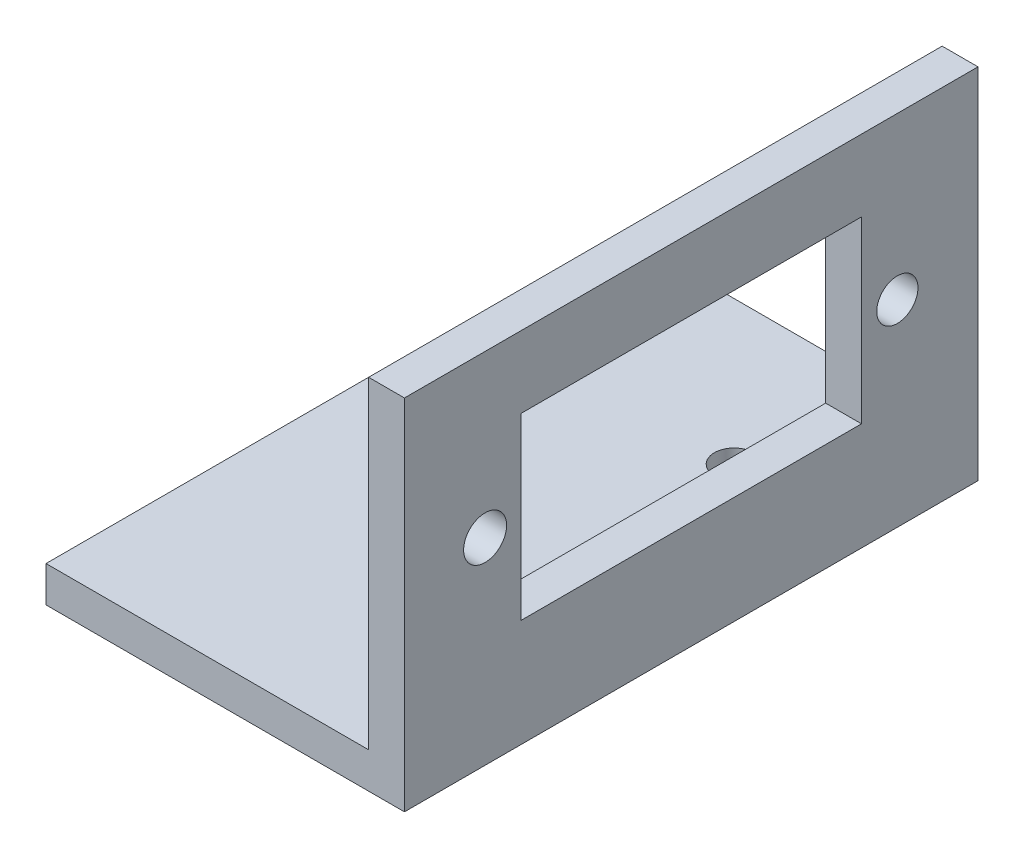
ISO-10303-21;
HEADER;
FILE_DESCRIPTION(('STEP AP214'),'2;1');
FILE_NAME('part.step','',(''),(''),'','','');
FILE_SCHEMA(('AUTOMOTIVE_DESIGN { 1 0 10303 214 1 1 1 1 }'));
ENDSEC;
DATA;
#1=APPLICATION_CONTEXT('core data for automotive mechanical design processes');
#2=APPLICATION_PROTOCOL_DEFINITION('international standard','automotive_design',2000,#1);
#3=PRODUCT_CONTEXT('',#1,'mechanical');
#4=PRODUCT('Part','Part','',(#3));
#5=PRODUCT_RELATED_PRODUCT_CATEGORY('part','',(#4));
#6=PRODUCT_DEFINITION_FORMATION('','',#4);
#7=PRODUCT_DEFINITION_CONTEXT('part definition',#1,'design');
#8=PRODUCT_DEFINITION('design','',#6,#7);
#9=PRODUCT_DEFINITION_SHAPE('','',#8);
#10=(LENGTH_UNIT() NAMED_UNIT(*) SI_UNIT(.MILLI.,.METRE.));
#11=(NAMED_UNIT(*) PLANE_ANGLE_UNIT() SI_UNIT($,.RADIAN.));
#12=(NAMED_UNIT(*) SI_UNIT($,.STERADIAN.) SOLID_ANGLE_UNIT());
#13=UNCERTAINTY_MEASURE_WITH_UNIT(LENGTH_MEASURE(1.E-05),#10,'distance_accuracy_value','');
#14=(GEOMETRIC_REPRESENTATION_CONTEXT(3) GLOBAL_UNCERTAINTY_ASSIGNED_CONTEXT((#13)) GLOBAL_UNIT_ASSIGNED_CONTEXT((#10,
#11,#12)) REPRESENTATION_CONTEXT('',''));
#15=CARTESIAN_POINT('',(0.,0.,0.));
#16=DIRECTION('',(0.,0.,1.));
#17=DIRECTION('',(1.,0.,0.));
#18=AXIS2_PLACEMENT_3D('',#15,#16,#17);
#19=CARTESIAN_POINT('',(-20.,2.,16.));
#20=DIRECTION('',(1.,0.,0.));
#21=DIRECTION('',(0.,0.,-1.));
#22=AXIS2_PLACEMENT_3D('',#19,#20,#21);
#23=PLANE('',#22);
#24=DIRECTION('',(0.,-1.,0.));
#25=VECTOR('',#24,1.);
#26=CARTESIAN_POINT('',(-20.,2.,-16.));
#27=LINE('',#26,#25);
#28=CARTESIAN_POINT('',(-20.,2.,-16.));
#29=VERTEX_POINT('',#28);
#30=CARTESIAN_POINT('',(-20.,0.,-16.));
#31=VERTEX_POINT('',#30);
#32=EDGE_CURVE('E160',#29,#31,#27,.T.);
#33=ORIENTED_EDGE('',*,*,#32,.T.);
#34=DIRECTION('',(0.,0.,-1.));
#35=VECTOR('',#34,1.);
#36=CARTESIAN_POINT('',(-20.,0.,16.));
#37=LINE('',#36,#35);
#38=CARTESIAN_POINT('',(-20.,0.,16.));
#39=VERTEX_POINT('',#38);
#40=EDGE_CURVE('E186',#39,#31,#37,.T.);
#41=ORIENTED_EDGE('',*,*,#40,.F.);
#42=DIRECTION('',(0.,-1.,0.));
#43=VECTOR('',#42,1.);
#44=CARTESIAN_POINT('',(-20.,2.,16.));
#45=LINE('',#44,#43);
#46=CARTESIAN_POINT('',(-20.,2.,16.));
#47=VERTEX_POINT('',#46);
#48=EDGE_CURVE('E145',#47,#39,#45,.T.);
#49=ORIENTED_EDGE('',*,*,#48,.F.);
#50=DIRECTION('',(0.,0.,-1.));
#51=VECTOR('',#50,1.);
#52=CARTESIAN_POINT('',(-20.,2.,16.));
#53=LINE('',#52,#51);
#54=EDGE_CURVE('E159',#47,#29,#53,.T.);
#55=ORIENTED_EDGE('',*,*,#54,.T.);
#56=EDGE_LOOP('',(#33,#41,#49,#55));
#57=FACE_BOUND('',#56,.T.);
#58=ADVANCED_FACE('F33',(#57),#23,.F.);
#59=CARTESIAN_POINT('',(-20.,0.,16.));
#60=DIRECTION('',(0.,1.,0.));
#61=DIRECTION('',(0.,0.,1.));
#62=AXIS2_PLACEMENT_3D('',#59,#60,#61);
#63=PLANE('',#62);
#64=CARTESIAN_POINT('',(-5.60975609756096,0.,8.));
#65=DIRECTION('',(0.,1.,0.));
#66=DIRECTION('',(0.,0.,1.));
#67=AXIS2_PLACEMENT_3D('',#64,#65,#66);
#68=CIRCLE('',#67,1.1);
#69=CARTESIAN_POINT('',(-5.60975609756096,0.,9.1));
#70=VERTEX_POINT('',#69);
#71=EDGE_CURVE('E352',#70,#70,#68,.T.);
#72=ORIENTED_EDGE('',*,*,#71,.T.);
#73=EDGE_LOOP('',(#72));
#74=FACE_BOUND('',#73,.T.);
#75=CARTESIAN_POINT('',(-5.60975609756096,0.,-8.));
#76=DIRECTION('',(0.,1.,0.));
#77=DIRECTION('',(0.,0.,1.));
#78=AXIS2_PLACEMENT_3D('',#75,#76,#77);
#79=CIRCLE('',#78,1.1);
#80=CARTESIAN_POINT('',(-5.60975609756096,0.,-6.9));
#81=VERTEX_POINT('',#80);
#82=EDGE_CURVE('E356',#81,#81,#79,.T.);
#83=ORIENTED_EDGE('',*,*,#82,.T.);
#84=EDGE_LOOP('',(#83));
#85=FACE_BOUND('',#84,.T.);
#86=DIRECTION('',(1.,0.,0.));
#87=VECTOR('',#86,1.);
#88=CARTESIAN_POINT('',(-20.,0.,-16.));
#89=LINE('',#88,#87);
#90=CARTESIAN_POINT('',(0.,0.,-16.));
#91=VERTEX_POINT('',#90);
#92=EDGE_CURVE('E163',#31,#91,#89,.T.);
#93=ORIENTED_EDGE('',*,*,#92,.T.);
#94=DIRECTION('',(0.,0.,-1.));
#95=VECTOR('',#94,1.);
#96=CARTESIAN_POINT('',(0.,0.,16.));
#97=LINE('',#96,#95);
#98=CARTESIAN_POINT('',(0.,0.,16.));
#99=VERTEX_POINT('',#98);
#100=EDGE_CURVE('E183',#99,#91,#97,.T.);
#101=ORIENTED_EDGE('',*,*,#100,.F.);
#102=DIRECTION('',(1.,0.,0.));
#103=VECTOR('',#102,1.);
#104=CARTESIAN_POINT('',(-20.,0.,16.));
#105=LINE('',#104,#103);
#106=EDGE_CURVE('E148',#39,#99,#105,.T.);
#107=ORIENTED_EDGE('',*,*,#106,.F.);
#108=ORIENTED_EDGE('',*,*,#40,.T.);
#109=EDGE_LOOP('',(#93,#101,#107,#108));
#110=FACE_BOUND('',#109,.T.);
#111=ADVANCED_FACE('F216',(#74,#85,#110),#63,.F.);
#112=CARTESIAN_POINT('',(0.,0.,16.));
#113=DIRECTION('',(-1.,0.,0.));
#114=DIRECTION('',(0.,0.,1.));
#115=AXIS2_PLACEMENT_3D('',#112,#113,#114);
#116=PLANE('',#115);
#117=DIRECTION('',(0.,0.,1.));
#118=VECTOR('',#117,1.);
#119=CARTESIAN_POINT('',(0.,16.,9.5));
#120=LINE('',#119,#118);
#121=CARTESIAN_POINT('',(0.,16.,-9.5));
#122=VERTEX_POINT('',#121);
#123=CARTESIAN_POINT('',(0.,16.,9.5));
#124=VERTEX_POINT('',#123);
#125=EDGE_CURVE('E121',#122,#124,#120,.T.);
#126=ORIENTED_EDGE('',*,*,#125,.F.);
#127=DIRECTION('',(0.,1.,0.));
#128=VECTOR('',#127,1.);
#129=CARTESIAN_POINT('',(0.,16.,-9.5));
#130=LINE('',#129,#128);
#131=CARTESIAN_POINT('',(0.,6.,-9.5));
#132=VERTEX_POINT('',#131);
#133=EDGE_CURVE('E47',#132,#122,#130,.T.);
#134=ORIENTED_EDGE('',*,*,#133,.F.);
#135=DIRECTION('',(0.,0.,-1.));
#136=VECTOR('',#135,1.);
#137=CARTESIAN_POINT('',(0.,6.,9.5));
#138=LINE('',#137,#136);
#139=CARTESIAN_POINT('',(0.,6.,9.5));
#140=VERTEX_POINT('',#139);
#141=EDGE_CURVE('E128',#140,#132,#138,.T.);
#142=ORIENTED_EDGE('',*,*,#141,.F.);
#143=DIRECTION('',(0.,-1.,0.));
#144=VECTOR('',#143,1.);
#145=CARTESIAN_POINT('',(0.,16.,9.5));
#146=LINE('',#145,#144);
#147=EDGE_CURVE('E112',#124,#140,#146,.T.);
#148=ORIENTED_EDGE('',*,*,#147,.F.);
#149=EDGE_LOOP('',(#126,#134,#142,#148));
#150=FACE_BOUND('',#149,.T.);
#151=CARTESIAN_POINT('',(0.,11.,11.5));
#152=DIRECTION('',(1.,0.,0.));
#153=DIRECTION('',(0.,0.,-1.));
#154=AXIS2_PLACEMENT_3D('',#151,#152,#153);
#155=CIRCLE('',#154,1.2);
#156=CARTESIAN_POINT('',(0.,11.,10.3));
#157=VERTEX_POINT('',#156);
#158=EDGE_CURVE('E135',#157,#157,#155,.T.);
#159=ORIENTED_EDGE('',*,*,#158,.F.);
#160=EDGE_LOOP('',(#159));
#161=FACE_BOUND('',#160,.T.);
#162=CARTESIAN_POINT('',(0.,11.,-11.5));
#163=DIRECTION('',(1.,0.,0.));
#164=DIRECTION('',(0.,0.,-1.));
#165=AXIS2_PLACEMENT_3D('',#162,#163,#164);
#166=CIRCLE('',#165,1.15);
#167=CARTESIAN_POINT('',(0.,11.,-12.65));
#168=VERTEX_POINT('',#167);
#169=EDGE_CURVE('E141',#168,#168,#166,.T.);
#170=ORIENTED_EDGE('',*,*,#169,.F.);
#171=EDGE_LOOP('',(#170));
#172=FACE_BOUND('',#171,.T.);
#173=DIRECTION('',(0.,1.,0.));
#174=VECTOR('',#173,1.);
#175=CARTESIAN_POINT('',(0.,0.,-16.));
#176=LINE('',#175,#174);
#177=CARTESIAN_POINT('',(0.,20.,-16.));
#178=VERTEX_POINT('',#177);
#179=EDGE_CURVE('E165',#91,#178,#176,.T.);
#180=ORIENTED_EDGE('',*,*,#179,.T.);
#181=DIRECTION('',(0.,0.,-1.));
#182=VECTOR('',#181,1.);
#183=CARTESIAN_POINT('',(0.,20.,16.));
#184=LINE('',#183,#182);
#185=CARTESIAN_POINT('',(0.,20.,16.));
#186=VERTEX_POINT('',#185);
#187=EDGE_CURVE('E180',#186,#178,#184,.T.);
#188=ORIENTED_EDGE('',*,*,#187,.F.);
#189=DIRECTION('',(0.,1.,0.));
#190=VECTOR('',#189,1.);
#191=CARTESIAN_POINT('',(0.,0.,16.));
#192=LINE('',#191,#190);
#193=EDGE_CURVE('E151',#99,#186,#192,.T.);
#194=ORIENTED_EDGE('',*,*,#193,.F.);
#195=ORIENTED_EDGE('',*,*,#100,.T.);
#196=EDGE_LOOP('',(#180,#188,#194,#195));
#197=FACE_BOUND('',#196,.T.);
#198=ADVANCED_FACE('F125',(#150,#161,#172,#197),#116,.F.);
#199=CARTESIAN_POINT('',(0.,20.,16.));
#200=DIRECTION('',(0.,-1.,0.));
#201=DIRECTION('',(0.,0.,-1.));
#202=AXIS2_PLACEMENT_3D('',#199,#200,#201);
#203=PLANE('',#202);
#204=DIRECTION('',(-1.,0.,0.));
#205=VECTOR('',#204,1.);
#206=CARTESIAN_POINT('',(0.,20.,-16.));
#207=LINE('',#206,#205);
#208=CARTESIAN_POINT('',(-2.,20.,-16.));
#209=VERTEX_POINT('',#208);
#210=EDGE_CURVE('E167',#178,#209,#207,.T.);
#211=ORIENTED_EDGE('',*,*,#210,.T.);
#212=DIRECTION('',(0.,0.,-1.));
#213=VECTOR('',#212,1.);
#214=CARTESIAN_POINT('',(-2.,20.,16.));
#215=LINE('',#214,#213);
#216=CARTESIAN_POINT('',(-2.,20.,16.));
#217=VERTEX_POINT('',#216);
#218=EDGE_CURVE('E177',#217,#209,#215,.T.);
#219=ORIENTED_EDGE('',*,*,#218,.F.);
#220=DIRECTION('',(-1.,0.,0.));
#221=VECTOR('',#220,1.);
#222=CARTESIAN_POINT('',(0.,20.,16.));
#223=LINE('',#222,#221);
#224=EDGE_CURVE('E153',#186,#217,#223,.T.);
#225=ORIENTED_EDGE('',*,*,#224,.F.);
#226=ORIENTED_EDGE('',*,*,#187,.T.);
#227=EDGE_LOOP('',(#211,#219,#225,#226));
#228=FACE_BOUND('',#227,.T.);
#229=ADVANCED_FACE('F245',(#228),#203,.F.);
#230=CARTESIAN_POINT('',(-2.,20.,16.));
#231=DIRECTION('',(1.,0.,0.));
#232=DIRECTION('',(0.,1.,0.));
#233=AXIS2_PLACEMENT_3D('',#230,#231,#232);
#234=PLANE('',#233);
#235=DIRECTION('',(0.,0.,-1.));
#236=VECTOR('',#235,1.);
#237=CARTESIAN_POINT('',(-2.,6.,16.));
#238=LINE('',#237,#236);
#239=CARTESIAN_POINT('',(-2.,6.,9.5));
#240=VERTEX_POINT('',#239);
#241=CARTESIAN_POINT('',(-2.,6.,-9.5));
#242=VERTEX_POINT('',#241);
#243=EDGE_CURVE('E40',#240,#242,#238,.T.);
#244=ORIENTED_EDGE('',*,*,#243,.T.);
#245=DIRECTION('',(0.,1.,0.));
#246=VECTOR('',#245,1.);
#247=CARTESIAN_POINT('',(-2.,20.,-9.5));
#248=LINE('',#247,#246);
#249=CARTESIAN_POINT('',(-2.,16.,-9.5));
#250=VERTEX_POINT('',#249);
#251=EDGE_CURVE('E11',#242,#250,#248,.T.);
#252=ORIENTED_EDGE('',*,*,#251,.T.);
#253=DIRECTION('',(0.,0.,1.));
#254=VECTOR('',#253,1.);
#255=CARTESIAN_POINT('',(-2.,16.,16.));
#256=LINE('',#255,#254);
#257=CARTESIAN_POINT('',(-2.,16.,9.5));
#258=VERTEX_POINT('',#257);
#259=EDGE_CURVE('E189',#250,#258,#256,.T.);
#260=ORIENTED_EDGE('',*,*,#259,.T.);
#261=DIRECTION('',(0.,-1.,0.));
#262=VECTOR('',#261,1.);
#263=CARTESIAN_POINT('',(-2.,20.,9.5));
#264=LINE('',#263,#262);
#265=EDGE_CURVE('E115',#258,#240,#264,.T.);
#266=ORIENTED_EDGE('',*,*,#265,.T.);
#267=EDGE_LOOP('',(#244,#252,#260,#266));
#268=FACE_BOUND('',#267,.T.);
#269=CARTESIAN_POINT('',(-2.,11.,11.5));
#270=DIRECTION('',(1.,0.,0.));
#271=DIRECTION('',(0.,1.,0.));
#272=AXIS2_PLACEMENT_3D('',#269,#270,#271);
#273=CIRCLE('',#272,1.2);
#274=CARTESIAN_POINT('',(-2.,12.2,11.5));
#275=VERTEX_POINT('',#274);
#276=EDGE_CURVE('E140',#275,#275,#273,.T.);
#277=ORIENTED_EDGE('',*,*,#276,.T.);
#278=EDGE_LOOP('',(#277));
#279=FACE_BOUND('',#278,.T.);
#280=CARTESIAN_POINT('',(-2.,11.,-11.5));
#281=DIRECTION('',(1.,0.,0.));
#282=DIRECTION('',(0.,1.,0.));
#283=AXIS2_PLACEMENT_3D('',#280,#281,#282);
#284=CIRCLE('',#283,1.15);
#285=CARTESIAN_POINT('',(-2.,12.15,-11.5));
#286=VERTEX_POINT('',#285);
#287=EDGE_CURVE('E144',#286,#286,#284,.T.);
#288=ORIENTED_EDGE('',*,*,#287,.T.);
#289=EDGE_LOOP('',(#288));
#290=FACE_BOUND('',#289,.T.);
#291=DIRECTION('',(0.,-1.,0.));
#292=VECTOR('',#291,1.);
#293=CARTESIAN_POINT('',(-2.,20.,-16.));
#294=LINE('',#293,#292);
#295=CARTESIAN_POINT('',(-2.,2.,-16.));
#296=VERTEX_POINT('',#295);
#297=EDGE_CURVE('E169',#209,#296,#294,.T.);
#298=ORIENTED_EDGE('',*,*,#297,.T.);
#299=DIRECTION('',(0.,0.,-1.));
#300=VECTOR('',#299,1.);
#301=CARTESIAN_POINT('',(-2.,2.,16.));
#302=LINE('',#301,#300);
#303=CARTESIAN_POINT('',(-2.,2.,16.));
#304=VERTEX_POINT('',#303);
#305=EDGE_CURVE('E174',#304,#296,#302,.T.);
#306=ORIENTED_EDGE('',*,*,#305,.F.);
#307=DIRECTION('',(0.,-1.,0.));
#308=VECTOR('',#307,1.);
#309=CARTESIAN_POINT('',(-2.,20.,16.));
#310=LINE('',#309,#308);
#311=EDGE_CURVE('E155',#217,#304,#310,.T.);
#312=ORIENTED_EDGE('',*,*,#311,.F.);
#313=ORIENTED_EDGE('',*,*,#218,.T.);
#314=EDGE_LOOP('',(#298,#306,#312,#313));
#315=FACE_BOUND('',#314,.T.);
#316=ADVANCED_FACE('F197',(#268,#279,#290,#315),#234,.F.);
#317=CARTESIAN_POINT('',(-2.,2.,16.));
#318=DIRECTION('',(0.,-1.,0.));
#319=DIRECTION('',(1.,0.,0.));
#320=AXIS2_PLACEMENT_3D('',#317,#318,#319);
#321=PLANE('',#320);
#322=CARTESIAN_POINT('',(-5.60975609756096,2.,8.));
#323=DIRECTION('',(0.,1.,0.));
#324=DIRECTION('',(-1.,0.,0.));
#325=AXIS2_PLACEMENT_3D('',#322,#323,#324);
#326=CIRCLE('',#325,1.1);
#327=CARTESIAN_POINT('',(-6.70975609756096,2.,8.));
#328=VERTEX_POINT('',#327);
#329=EDGE_CURVE('E349',#328,#328,#326,.T.);
#330=ORIENTED_EDGE('',*,*,#329,.F.);
#331=EDGE_LOOP('',(#330));
#332=FACE_BOUND('',#331,.T.);
#333=CARTESIAN_POINT('',(-5.60975609756096,2.,-8.));
#334=DIRECTION('',(0.,1.,0.));
#335=DIRECTION('',(-1.,0.,0.));
#336=AXIS2_PLACEMENT_3D('',#333,#334,#335);
#337=CIRCLE('',#336,1.1);
#338=CARTESIAN_POINT('',(-6.70975609756096,2.,-8.));
#339=VERTEX_POINT('',#338);
#340=EDGE_CURVE('E353',#339,#339,#337,.T.);
#341=ORIENTED_EDGE('',*,*,#340,.F.);
#342=EDGE_LOOP('',(#341));
#343=FACE_BOUND('',#342,.T.);
#344=DIRECTION('',(-1.,0.,0.));
#345=VECTOR('',#344,1.);
#346=CARTESIAN_POINT('',(-2.,2.,-16.));
#347=LINE('',#346,#345);
#348=EDGE_CURVE('E149',#296,#29,#347,.T.);
#349=ORIENTED_EDGE('',*,*,#348,.T.);
#350=ORIENTED_EDGE('',*,*,#54,.F.);
#351=DIRECTION('',(-1.,0.,0.));
#352=VECTOR('',#351,1.);
#353=CARTESIAN_POINT('',(-2.,2.,16.));
#354=LINE('',#353,#352);
#355=EDGE_CURVE('E157',#304,#47,#354,.T.);
#356=ORIENTED_EDGE('',*,*,#355,.F.);
#357=ORIENTED_EDGE('',*,*,#305,.T.);
#358=EDGE_LOOP('',(#349,#350,#356,#357));
#359=FACE_BOUND('',#358,.T.);
#360=ADVANCED_FACE('F241',(#332,#343,#359),#321,.F.);
#361=CARTESIAN_POINT('',(0.,0.,16.));
#362=DIRECTION('',(0.,0.,1.));
#363=DIRECTION('',(1.,0.,0.));
#364=AXIS2_PLACEMENT_3D('',#361,#362,#363);
#365=PLANE('',#364);
#366=ORIENTED_EDGE('',*,*,#48,.T.);
#367=ORIENTED_EDGE('',*,*,#106,.T.);
#368=ORIENTED_EDGE('',*,*,#193,.T.);
#369=ORIENTED_EDGE('',*,*,#224,.T.);
#370=ORIENTED_EDGE('',*,*,#311,.T.);
#371=ORIENTED_EDGE('',*,*,#355,.T.);
#372=EDGE_LOOP('',(#366,#367,#368,#369,#370,#371));
#373=FACE_BOUND('',#372,.T.);
#374=ADVANCED_FACE('F236',(#373),#365,.T.);
#375=CARTESIAN_POINT('',(0.,0.,-16.));
#376=DIRECTION('',(0.,0.,1.));
#377=DIRECTION('',(1.,0.,0.));
#378=AXIS2_PLACEMENT_3D('',#375,#376,#377);
#379=PLANE('',#378);
#380=ORIENTED_EDGE('',*,*,#32,.F.);
#381=ORIENTED_EDGE('',*,*,#348,.F.);
#382=ORIENTED_EDGE('',*,*,#297,.F.);
#383=ORIENTED_EDGE('',*,*,#210,.F.);
#384=ORIENTED_EDGE('',*,*,#179,.F.);
#385=ORIENTED_EDGE('',*,*,#92,.F.);
#386=EDGE_LOOP('',(#380,#381,#382,#383,#384,#385));
#387=FACE_BOUND('',#386,.T.);
#388=ADVANCED_FACE('F228',(#387),#379,.F.);
#389=CARTESIAN_POINT('',(-30.,11.,-11.5));
#390=DIRECTION('',(1.,0.,0.));
#391=DIRECTION('',(0.,0.,-1.));
#392=AXIS2_PLACEMENT_3D('',#389,#390,#391);
#393=CYLINDRICAL_SURFACE('',#392,1.15);
#394=ORIENTED_EDGE('',*,*,#169,.T.);
#395=EDGE_LOOP('',(#394));
#396=FACE_BOUND('',#395,.T.);
#397=ORIENTED_EDGE('',*,*,#287,.F.);
#398=EDGE_LOOP('',(#397));
#399=FACE_BOUND('',#398,.T.);
#400=ADVANCED_FACE('F211',(#396,#399),#393,.F.);
#401=CARTESIAN_POINT('',(-30.,11.,11.5));
#402=DIRECTION('',(1.,0.,0.));
#403=DIRECTION('',(0.,0.,-1.));
#404=AXIS2_PLACEMENT_3D('',#401,#402,#403);
#405=CYLINDRICAL_SURFACE('',#404,1.2);
#406=ORIENTED_EDGE('',*,*,#158,.T.);
#407=EDGE_LOOP('',(#406));
#408=FACE_BOUND('',#407,.T.);
#409=ORIENTED_EDGE('',*,*,#276,.F.);
#410=EDGE_LOOP('',(#409));
#411=FACE_BOUND('',#410,.T.);
#412=ADVANCED_FACE('F204',(#408,#411),#405,.F.);
#413=CARTESIAN_POINT('',(-30.,16.,-9.5));
#414=DIRECTION('',(0.,0.,-1.));
#415=DIRECTION('',(-1.,0.,0.));
#416=AXIS2_PLACEMENT_3D('',#413,#414,#415);
#417=PLANE('',#416);
#418=DIRECTION('',(1.,0.,0.));
#419=VECTOR('',#418,1.);
#420=CARTESIAN_POINT('',(-30.,6.,-9.5));
#421=LINE('',#420,#419);
#422=EDGE_CURVE('E133',#242,#132,#421,.T.);
#423=ORIENTED_EDGE('',*,*,#422,.T.);
#424=ORIENTED_EDGE('',*,*,#133,.T.);
#425=DIRECTION('',(1.,0.,0.));
#426=VECTOR('',#425,1.);
#427=CARTESIAN_POINT('',(-30.,16.,-9.5));
#428=LINE('',#427,#426);
#429=EDGE_CURVE('E118',#250,#122,#428,.T.);
#430=ORIENTED_EDGE('',*,*,#429,.F.);
#431=ORIENTED_EDGE('',*,*,#251,.F.);
#432=EDGE_LOOP('',(#423,#424,#430,#431));
#433=FACE_BOUND('',#432,.T.);
#434=ADVANCED_FACE('F202',(#433),#417,.F.);
#435=CARTESIAN_POINT('',(-30.,6.,9.5));
#436=DIRECTION('',(0.,-1.,0.));
#437=DIRECTION('',(0.,0.,-1.));
#438=AXIS2_PLACEMENT_3D('',#435,#436,#437);
#439=PLANE('',#438);
#440=DIRECTION('',(1.,0.,0.));
#441=VECTOR('',#440,1.);
#442=CARTESIAN_POINT('',(-30.,6.,9.5));
#443=LINE('',#442,#441);
#444=EDGE_CURVE('E117',#240,#140,#443,.T.);
#445=ORIENTED_EDGE('',*,*,#444,.T.);
#446=ORIENTED_EDGE('',*,*,#141,.T.);
#447=ORIENTED_EDGE('',*,*,#422,.F.);
#448=ORIENTED_EDGE('',*,*,#243,.F.);
#449=EDGE_LOOP('',(#445,#446,#447,#448));
#450=FACE_BOUND('',#449,.T.);
#451=ADVANCED_FACE('F201',(#450),#439,.F.);
#452=CARTESIAN_POINT('',(-30.,16.,9.5));
#453=DIRECTION('',(0.,0.,1.));
#454=DIRECTION('',(0.,-1.,0.));
#455=AXIS2_PLACEMENT_3D('',#452,#453,#454);
#456=PLANE('',#455);
#457=DIRECTION('',(1.,0.,0.));
#458=VECTOR('',#457,1.);
#459=CARTESIAN_POINT('',(-30.,16.,9.5));
#460=LINE('',#459,#458);
#461=EDGE_CURVE('E55',#258,#124,#460,.T.);
#462=ORIENTED_EDGE('',*,*,#461,.T.);
#463=ORIENTED_EDGE('',*,*,#147,.T.);
#464=ORIENTED_EDGE('',*,*,#444,.F.);
#465=ORIENTED_EDGE('',*,*,#265,.F.);
#466=EDGE_LOOP('',(#462,#463,#464,#465));
#467=FACE_BOUND('',#466,.T.);
#468=ADVANCED_FACE('F109',(#467),#456,.F.);
#469=CARTESIAN_POINT('',(-30.,16.,9.5));
#470=DIRECTION('',(0.,1.,0.));
#471=DIRECTION('',(0.,0.,1.));
#472=AXIS2_PLACEMENT_3D('',#469,#470,#471);
#473=PLANE('',#472);
#474=ORIENTED_EDGE('',*,*,#429,.T.);
#475=ORIENTED_EDGE('',*,*,#125,.T.);
#476=ORIENTED_EDGE('',*,*,#461,.F.);
#477=ORIENTED_EDGE('',*,*,#259,.F.);
#478=EDGE_LOOP('',(#474,#475,#476,#477));
#479=FACE_BOUND('',#478,.T.);
#480=ADVANCED_FACE('F122',(#479),#473,.F.);
#481=CARTESIAN_POINT('',(-5.60975609756095,-28.,-8.));
#482=DIRECTION('',(0.,1.,0.));
#483=DIRECTION('',(-1.,0.,0.));
#484=AXIS2_PLACEMENT_3D('',#481,#482,#483);
#485=CYLINDRICAL_SURFACE('',#484,1.1);
#486=ORIENTED_EDGE('',*,*,#340,.T.);
#487=EDGE_LOOP('',(#486));
#488=FACE_BOUND('',#487,.T.);
#489=ORIENTED_EDGE('',*,*,#82,.F.);
#490=EDGE_LOOP('',(#489));
#491=FACE_BOUND('',#490,.T.);
#492=ADVANCED_FACE('F308',(#488,#491),#485,.F.);
#493=CARTESIAN_POINT('',(-5.60975609756095,-28.,8.));
#494=DIRECTION('',(0.,1.,0.));
#495=DIRECTION('',(-1.,0.,0.));
#496=AXIS2_PLACEMENT_3D('',#493,#494,#495);
#497=CYLINDRICAL_SURFACE('',#496,1.1);
#498=ORIENTED_EDGE('',*,*,#329,.T.);
#499=EDGE_LOOP('',(#498));
#500=FACE_BOUND('',#499,.T.);
#501=ORIENTED_EDGE('',*,*,#71,.F.);
#502=EDGE_LOOP('',(#501));
#503=FACE_BOUND('',#502,.T.);
#504=ADVANCED_FACE('F332',(#500,#503),#497,.F.);
#505=CLOSED_SHELL('',(#58,#111,#198,#229,#316,#360,#374,#388,#400,#412,#434,#451,#468,#480,#492,#504));
#506=MANIFOLD_SOLID_BREP('B2',#505);
#507=ADVANCED_BREP_SHAPE_REPRESENTATION('',(#18,#506),#14);
#508=SHAPE_DEFINITION_REPRESENTATION(#9,#507);
ENDSEC;
END-ISO-10303-21;
